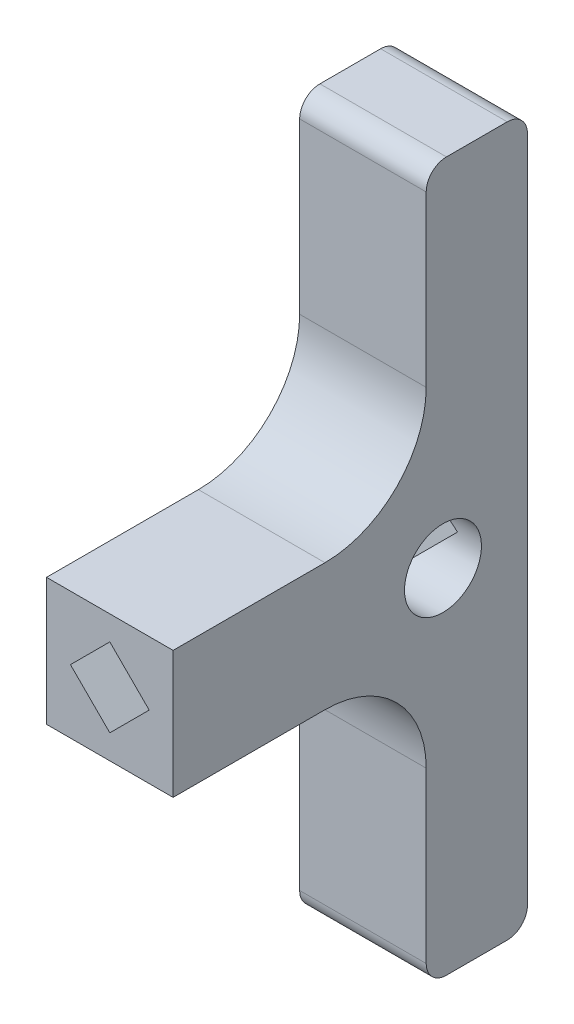
ISO-10303-21;
HEADER;
FILE_DESCRIPTION(('STEP AP214'),'2;1');
FILE_NAME('part.step','',(''),(''),'','','');
FILE_SCHEMA(('AUTOMOTIVE_DESIGN { 1 0 10303 214 1 1 1 1 }'));
ENDSEC;
DATA;
#1=APPLICATION_CONTEXT('core data for automotive mechanical design processes');
#2=APPLICATION_PROTOCOL_DEFINITION('international standard','automotive_design',2000,#1);
#3=PRODUCT_CONTEXT('',#1,'mechanical');
#4=PRODUCT('Part','Part','',(#3));
#5=PRODUCT_RELATED_PRODUCT_CATEGORY('part','',(#4));
#6=PRODUCT_DEFINITION_FORMATION('','',#4);
#7=PRODUCT_DEFINITION_CONTEXT('part definition',#1,'design');
#8=PRODUCT_DEFINITION('design','',#6,#7);
#9=PRODUCT_DEFINITION_SHAPE('','',#8);
#10=(LENGTH_UNIT() NAMED_UNIT(*) SI_UNIT(.MILLI.,.METRE.));
#11=(NAMED_UNIT(*) PLANE_ANGLE_UNIT() SI_UNIT($,.RADIAN.));
#12=(NAMED_UNIT(*) SI_UNIT($,.STERADIAN.) SOLID_ANGLE_UNIT());
#13=UNCERTAINTY_MEASURE_WITH_UNIT(LENGTH_MEASURE(1.E-05),#10,'distance_accuracy_value','');
#14=(GEOMETRIC_REPRESENTATION_CONTEXT(3) GLOBAL_UNCERTAINTY_ASSIGNED_CONTEXT((#13)) GLOBAL_UNIT_ASSIGNED_CONTEXT((#10,
#11,#12)) REPRESENTATION_CONTEXT('',''));
#15=CARTESIAN_POINT('',(0.,0.,0.));
#16=DIRECTION('',(0.,0.,1.));
#17=DIRECTION('',(1.,0.,0.));
#18=AXIS2_PLACEMENT_3D('',#15,#16,#17);
#19=CARTESIAN_POINT('',(6.25,35.,10.));
#20=DIRECTION('',(-1.,0.,0.));
#21=DIRECTION('',(0.,-1.,0.));
#22=AXIS2_PLACEMENT_3D('',#19,#20,#21);
#23=PLANE('',#22);
#24=DIRECTION('',(0.,1.,0.));
#25=VECTOR('',#24,1.);
#26=CARTESIAN_POINT('',(6.25,35.,10.));
#27=LINE('',#26,#25);
#28=CARTESIAN_POINT('',(6.25000000000001,-33.,10.));
#29=VERTEX_POINT('',#28);
#30=CARTESIAN_POINT('',(6.25,-16.2884586432121,10.));
#31=VERTEX_POINT('',#30);
#32=EDGE_CURVE('E220',#29,#31,#27,.T.);
#33=ORIENTED_EDGE('',*,*,#32,.F.);
#34=CARTESIAN_POINT('',(6.25000000000001,-33.,8.));
#35=DIRECTION('',(-1.,0.,0.));
#36=DIRECTION('',(0.,-1.,0.));
#37=AXIS2_PLACEMENT_3D('',#34,#35,#36);
#38=CIRCLE('',#37,2.);
#39=CARTESIAN_POINT('',(6.25000000000001,-35.,8.));
#40=VERTEX_POINT('',#39);
#41=EDGE_CURVE('E281',#29,#40,#38,.F.);
#42=ORIENTED_EDGE('',*,*,#41,.T.);
#43=DIRECTION('',(0.,0.,-1.));
#44=VECTOR('',#43,1.);
#45=CARTESIAN_POINT('',(6.25000000000001,-35.,10.));
#46=LINE('',#45,#44);
#47=CARTESIAN_POINT('',(6.25000000000001,-35.,2.));
#48=VERTEX_POINT('',#47);
#49=EDGE_CURVE('E226',#40,#48,#46,.T.);
#50=ORIENTED_EDGE('',*,*,#49,.T.);
#51=CARTESIAN_POINT('',(6.25000000000001,-33.,2.));
#52=DIRECTION('',(-1.,0.,0.));
#53=DIRECTION('',(0.,-1.,0.));
#54=AXIS2_PLACEMENT_3D('',#51,#52,#53);
#55=CIRCLE('',#54,2.);
#56=CARTESIAN_POINT('',(6.25000000000001,-33.,0.));
#57=VERTEX_POINT('',#56);
#58=EDGE_CURVE('E279',#48,#57,#55,.F.);
#59=ORIENTED_EDGE('',*,*,#58,.T.);
#60=DIRECTION('',(0.,1.,0.));
#61=VECTOR('',#60,1.);
#62=CARTESIAN_POINT('',(6.25,35.,0.));
#63=LINE('',#62,#61);
#64=CARTESIAN_POINT('',(6.25,33.,0.));
#65=VERTEX_POINT('',#64);
#66=EDGE_CURVE('E211',#57,#65,#63,.T.);
#67=ORIENTED_EDGE('',*,*,#66,.T.);
#68=CARTESIAN_POINT('',(6.25,33.,2.));
#69=DIRECTION('',(-1.,0.,0.));
#70=DIRECTION('',(0.,-1.,0.));
#71=AXIS2_PLACEMENT_3D('',#68,#69,#70);
#72=CIRCLE('',#71,2.);
#73=CARTESIAN_POINT('',(6.25,35.,2.));
#74=VERTEX_POINT('',#73);
#75=EDGE_CURVE('E277',#65,#74,#72,.F.);
#76=ORIENTED_EDGE('',*,*,#75,.T.);
#77=DIRECTION('',(0.,0.,-1.));
#78=VECTOR('',#77,1.);
#79=CARTESIAN_POINT('',(6.25,35.,10.));
#80=LINE('',#79,#78);
#81=CARTESIAN_POINT('',(6.25,35.,8.));
#82=VERTEX_POINT('',#81);
#83=EDGE_CURVE('E240',#82,#74,#80,.T.);
#84=ORIENTED_EDGE('',*,*,#83,.F.);
#85=CARTESIAN_POINT('',(6.25,33.,8.));
#86=DIRECTION('',(-1.,0.,0.));
#87=DIRECTION('',(0.,-1.,0.));
#88=AXIS2_PLACEMENT_3D('',#85,#86,#87);
#89=CIRCLE('',#88,2.);
#90=CARTESIAN_POINT('',(6.25,33.,10.));
#91=VERTEX_POINT('',#90);
#92=EDGE_CURVE('E275',#82,#91,#89,.F.);
#93=ORIENTED_EDGE('',*,*,#92,.T.);
#94=CARTESIAN_POINT('',(6.25,16.2884586432121,10.));
#95=VERTEX_POINT('',#94);
#96=EDGE_CURVE('E223',#95,#91,#27,.T.);
#97=ORIENTED_EDGE('',*,*,#96,.F.);
#98=CARTESIAN_POINT('',(6.25,16.2884586432121,20.));
#99=DIRECTION('',(-1.,0.,0.));
#100=DIRECTION('',(0.,-1.,0.));
#101=AXIS2_PLACEMENT_3D('',#98,#99,#100);
#102=CIRCLE('',#101,10.);
#103=CARTESIAN_POINT('',(6.25,6.28845864321206,20.));
#104=VERTEX_POINT('',#103);
#105=EDGE_CURVE('E270',#95,#104,#102,.T.);
#106=ORIENTED_EDGE('',*,*,#105,.T.);
#107=DIRECTION('',(0.,0.,-1.));
#108=VECTOR('',#107,1.);
#109=CARTESIAN_POINT('',(6.25,6.28845864321206,35.));
#110=LINE('',#109,#108);
#111=CARTESIAN_POINT('',(6.25,6.28845864321206,35.));
#112=VERTEX_POINT('',#111);
#113=EDGE_CURVE('E215',#112,#104,#110,.T.);
#114=ORIENTED_EDGE('',*,*,#113,.F.);
#115=DIRECTION('',(0.,-1.,0.));
#116=VECTOR('',#115,1.);
#117=CARTESIAN_POINT('',(6.25,6.28845864321206,35.));
#118=LINE('',#117,#116);
#119=CARTESIAN_POINT('',(6.25,-6.28845864321206,35.));
#120=VERTEX_POINT('',#119);
#121=EDGE_CURVE('E201',#112,#120,#118,.T.);
#122=ORIENTED_EDGE('',*,*,#121,.T.);
#123=DIRECTION('',(0.,0.,-1.));
#124=VECTOR('',#123,1.);
#125=CARTESIAN_POINT('',(6.25,-6.28845864321206,35.));
#126=LINE('',#125,#124);
#127=CARTESIAN_POINT('',(6.25,-6.28845864321206,20.));
#128=VERTEX_POINT('',#127);
#129=EDGE_CURVE('E212',#120,#128,#126,.T.);
#130=ORIENTED_EDGE('',*,*,#129,.T.);
#131=CARTESIAN_POINT('',(6.25,-16.2884586432121,20.));
#132=DIRECTION('',(-1.,0.,0.));
#133=DIRECTION('',(0.,-1.,0.));
#134=AXIS2_PLACEMENT_3D('',#131,#132,#133);
#135=CIRCLE('',#134,10.);
#136=EDGE_CURVE('E262',#128,#31,#135,.T.);
#137=ORIENTED_EDGE('',*,*,#136,.T.);
#138=EDGE_LOOP('',(#33,#42,#50,#59,#67,#76,#84,#93,#97,#106,#114,#122,#130,#137));
#139=FACE_BOUND('',#138,.T.);
#140=CARTESIAN_POINT('',(6.25,0.,8.34476247266945));
#141=DIRECTION('',(-1.,0.,0.));
#142=DIRECTION('',(0.,-1.,0.));
#143=AXIS2_PLACEMENT_3D('',#140,#141,#142);
#144=CIRCLE('',#143,3.79999999999999);
#145=CARTESIAN_POINT('',(6.25,-3.79999999999999,8.34476247266945));
#146=VERTEX_POINT('',#145);
#147=EDGE_CURVE('E177',#146,#146,#144,.F.);
#148=ORIENTED_EDGE('',*,*,#147,.F.);
#149=EDGE_LOOP('',(#148));
#150=FACE_BOUND('',#149,.T.);
#151=ADVANCED_FACE('F33',(#139,#150),#23,.F.);
#152=CARTESIAN_POINT('',(0.,0.,10.));
#153=DIRECTION('',(0.,0.,1.));
#154=DIRECTION('',(1.,0.,0.));
#155=AXIS2_PLACEMENT_3D('',#152,#153,#154);
#156=PLANE('',#155);
#157=DIRECTION('',(0.,-1.,0.));
#158=VECTOR('',#157,1.);
#159=CARTESIAN_POINT('',(-6.25000000000001,35.,10.));
#160=LINE('',#159,#158);
#161=CARTESIAN_POINT('',(-6.25,-16.2884586432121,10.));
#162=VERTEX_POINT('',#161);
#163=CARTESIAN_POINT('',(-6.25,-33.,10.));
#164=VERTEX_POINT('',#163);
#165=EDGE_CURVE('E222',#162,#164,#160,.T.);
#166=ORIENTED_EDGE('',*,*,#165,.T.);
#167=DIRECTION('',(1.,0.,0.));
#168=VECTOR('',#167,1.);
#169=CARTESIAN_POINT('',(6.25000000000001,-33.,10.));
#170=LINE('',#169,#168);
#171=EDGE_CURVE('E272',#164,#29,#170,.T.);
#172=ORIENTED_EDGE('',*,*,#171,.T.);
#173=ORIENTED_EDGE('',*,*,#32,.T.);
#174=DIRECTION('',(1.,0.,0.));
#175=VECTOR('',#174,1.);
#176=CARTESIAN_POINT('',(-6.25,-16.2884586432121,10.));
#177=LINE('',#176,#175);
#178=EDGE_CURVE('E255',#31,#162,#177,.F.);
#179=ORIENTED_EDGE('',*,*,#178,.T.);
#180=EDGE_LOOP('',(#166,#172,#173,#179));
#181=FACE_BOUND('',#180,.T.);
#182=ADVANCED_FACE('F355',(#181),#156,.T.);
#183=CARTESIAN_POINT('',(-6.25000000000001,35.,10.));
#184=DIRECTION('',(0.,-1.,0.));
#185=DIRECTION('',(0.,0.,-1.));
#186=AXIS2_PLACEMENT_3D('',#183,#184,#185);
#187=PLANE('',#186);
#188=ORIENTED_EDGE('',*,*,#83,.T.);
#189=DIRECTION('',(-1.,0.,0.));
#190=VECTOR('',#189,1.);
#191=CARTESIAN_POINT('',(-6.25000000000001,35.,2.));
#192=LINE('',#191,#190);
#193=CARTESIAN_POINT('',(-6.25000000000001,35.,2.));
#194=VERTEX_POINT('',#193);
#195=EDGE_CURVE('E302',#74,#194,#192,.T.);
#196=ORIENTED_EDGE('',*,*,#195,.T.);
#197=DIRECTION('',(0.,0.,-1.));
#198=VECTOR('',#197,1.);
#199=CARTESIAN_POINT('',(-6.25000000000001,35.,10.));
#200=LINE('',#199,#198);
#201=CARTESIAN_POINT('',(-6.25000000000001,35.,8.));
#202=VERTEX_POINT('',#201);
#203=EDGE_CURVE('E237',#202,#194,#200,.T.);
#204=ORIENTED_EDGE('',*,*,#203,.F.);
#205=DIRECTION('',(-1.,0.,0.));
#206=VECTOR('',#205,1.);
#207=CARTESIAN_POINT('',(6.25,35.,8.));
#208=LINE('',#207,#206);
#209=EDGE_CURVE('E300',#202,#82,#208,.F.);
#210=ORIENTED_EDGE('',*,*,#209,.T.);
#211=EDGE_LOOP('',(#188,#196,#204,#210));
#212=FACE_BOUND('',#211,.T.);
#213=ADVANCED_FACE('F328',(#212),#187,.F.);
#214=CARTESIAN_POINT('',(-6.25000000000001,35.,10.));
#215=DIRECTION('',(1.,0.,0.));
#216=DIRECTION('',(0.,1.,0.));
#217=AXIS2_PLACEMENT_3D('',#214,#215,#216);
#218=PLANE('',#217);
#219=CARTESIAN_POINT('',(-6.25,0.,8.34476247266945));
#220=DIRECTION('',(-1.,0.,0.));
#221=DIRECTION('',(0.,0.,1.));
#222=AXIS2_PLACEMENT_3D('',#219,#220,#221);
#223=CIRCLE('',#222,3.79999999999999);
#224=CARTESIAN_POINT('',(-6.25,0.,12.1447624726694));
#225=VERTEX_POINT('',#224);
#226=EDGE_CURVE('E440',#225,#225,#223,.T.);
#227=ORIENTED_EDGE('',*,*,#226,.F.);
#228=EDGE_LOOP('',(#227));
#229=FACE_BOUND('',#228,.T.);
#230=DIRECTION('',(0.,0.,-1.));
#231=VECTOR('',#230,1.);
#232=CARTESIAN_POINT('',(-6.25,-35.,10.));
#233=LINE('',#232,#231);
#234=CARTESIAN_POINT('',(-6.25,-35.,8.));
#235=VERTEX_POINT('',#234);
#236=CARTESIAN_POINT('',(-6.25,-35.,2.));
#237=VERTEX_POINT('',#236);
#238=EDGE_CURVE('E234',#235,#237,#233,.T.);
#239=ORIENTED_EDGE('',*,*,#238,.F.);
#240=CARTESIAN_POINT('',(-6.25,-33.,8.));
#241=DIRECTION('',(1.,0.,0.));
#242=DIRECTION('',(0.,1.,0.));
#243=AXIS2_PLACEMENT_3D('',#240,#241,#242);
#244=CIRCLE('',#243,2.);
#245=EDGE_CURVE('E294',#235,#164,#244,.F.);
#246=ORIENTED_EDGE('',*,*,#245,.T.);
#247=ORIENTED_EDGE('',*,*,#165,.F.);
#248=CARTESIAN_POINT('',(-6.25,-16.2884586432121,20.));
#249=DIRECTION('',(1.,0.,0.));
#250=DIRECTION('',(0.,1.,0.));
#251=AXIS2_PLACEMENT_3D('',#248,#249,#250);
#252=CIRCLE('',#251,10.);
#253=CARTESIAN_POINT('',(-6.25,-6.28845864321206,20.));
#254=VERTEX_POINT('',#253);
#255=EDGE_CURVE('E265',#162,#254,#252,.T.);
#256=ORIENTED_EDGE('',*,*,#255,.T.);
#257=DIRECTION('',(0.,0.,-1.));
#258=VECTOR('',#257,1.);
#259=CARTESIAN_POINT('',(-6.25,-6.28845864321206,35.));
#260=LINE('',#259,#258);
#261=CARTESIAN_POINT('',(-6.25,-6.28845864321206,35.));
#262=VERTEX_POINT('',#261);
#263=EDGE_CURVE('E208',#262,#254,#260,.T.);
#264=ORIENTED_EDGE('',*,*,#263,.F.);
#265=DIRECTION('',(0.,1.,0.));
#266=VECTOR('',#265,1.);
#267=CARTESIAN_POINT('',(-6.25,6.28845864321206,35.));
#268=LINE('',#267,#266);
#269=CARTESIAN_POINT('',(-6.25,6.28845864321206,35.));
#270=VERTEX_POINT('',#269);
#271=EDGE_CURVE('E194',#262,#270,#268,.T.);
#272=ORIENTED_EDGE('',*,*,#271,.T.);
#273=DIRECTION('',(0.,0.,-1.));
#274=VECTOR('',#273,1.);
#275=CARTESIAN_POINT('',(-6.25,6.28845864321206,35.));
#276=LINE('',#275,#274);
#277=CARTESIAN_POINT('',(-6.25,6.28845864321206,20.));
#278=VERTEX_POINT('',#277);
#279=EDGE_CURVE('E207',#270,#278,#276,.T.);
#280=ORIENTED_EDGE('',*,*,#279,.T.);
#281=CARTESIAN_POINT('',(-6.25,16.2884586432121,20.));
#282=DIRECTION('',(1.,0.,0.));
#283=DIRECTION('',(0.,1.,0.));
#284=AXIS2_PLACEMENT_3D('',#281,#282,#283);
#285=CIRCLE('',#284,10.);
#286=CARTESIAN_POINT('',(-6.25,16.2884586432121,10.));
#287=VERTEX_POINT('',#286);
#288=EDGE_CURVE('E267',#278,#287,#285,.T.);
#289=ORIENTED_EDGE('',*,*,#288,.T.);
#290=CARTESIAN_POINT('',(-6.25000000000001,33.,10.));
#291=VERTEX_POINT('',#290);
#292=EDGE_CURVE('E224',#291,#287,#160,.T.);
#293=ORIENTED_EDGE('',*,*,#292,.F.);
#294=CARTESIAN_POINT('',(-6.25000000000001,33.,8.));
#295=DIRECTION('',(1.,0.,0.));
#296=DIRECTION('',(0.,1.,0.));
#297=AXIS2_PLACEMENT_3D('',#294,#295,#296);
#298=CIRCLE('',#297,2.);
#299=EDGE_CURVE('E288',#291,#202,#298,.F.);
#300=ORIENTED_EDGE('',*,*,#299,.T.);
#301=ORIENTED_EDGE('',*,*,#203,.T.);
#302=CARTESIAN_POINT('',(-6.25000000000001,33.,2.));
#303=DIRECTION('',(1.,0.,0.));
#304=DIRECTION('',(0.,1.,0.));
#305=AXIS2_PLACEMENT_3D('',#302,#303,#304);
#306=CIRCLE('',#305,2.);
#307=CARTESIAN_POINT('',(-6.25000000000001,33.,0.));
#308=VERTEX_POINT('',#307);
#309=EDGE_CURVE('E290',#194,#308,#306,.F.);
#310=ORIENTED_EDGE('',*,*,#309,.T.);
#311=DIRECTION('',(0.,-1.,0.));
#312=VECTOR('',#311,1.);
#313=CARTESIAN_POINT('',(-6.25000000000001,35.,0.));
#314=LINE('',#313,#312);
#315=CARTESIAN_POINT('',(-6.25,-33.,0.));
#316=VERTEX_POINT('',#315);
#317=EDGE_CURVE('E229',#308,#316,#314,.T.);
#318=ORIENTED_EDGE('',*,*,#317,.T.);
#319=CARTESIAN_POINT('',(-6.25,-33.,2.));
#320=DIRECTION('',(1.,0.,0.));
#321=DIRECTION('',(0.,1.,0.));
#322=AXIS2_PLACEMENT_3D('',#319,#320,#321);
#323=CIRCLE('',#322,2.);
#324=EDGE_CURVE('E292',#316,#237,#323,.F.);
#325=ORIENTED_EDGE('',*,*,#324,.T.);
#326=EDGE_LOOP('',(#239,#246,#247,#256,#264,#272,#280,#289,#293,#300,#301,#310,#318,#325));
#327=FACE_BOUND('',#326,.T.);
#328=ADVANCED_FACE('F315',(#229,#327),#218,.F.);
#329=CARTESIAN_POINT('',(-6.25,-35.,10.));
#330=DIRECTION('',(0.,1.,0.));
#331=DIRECTION('',(0.,0.,1.));
#332=AXIS2_PLACEMENT_3D('',#329,#330,#331);
#333=PLANE('',#332);
#334=ORIENTED_EDGE('',*,*,#49,.F.);
#335=DIRECTION('',(1.,0.,0.));
#336=VECTOR('',#335,1.);
#337=CARTESIAN_POINT('',(-6.25,-35.,8.));
#338=LINE('',#337,#336);
#339=EDGE_CURVE('E286',#40,#235,#338,.F.);
#340=ORIENTED_EDGE('',*,*,#339,.T.);
#341=ORIENTED_EDGE('',*,*,#238,.T.);
#342=DIRECTION('',(1.,0.,0.));
#343=VECTOR('',#342,1.);
#344=CARTESIAN_POINT('',(-6.25,-35.,2.));
#345=LINE('',#344,#343);
#346=EDGE_CURVE('E283',#237,#48,#345,.T.);
#347=ORIENTED_EDGE('',*,*,#346,.T.);
#348=EDGE_LOOP('',(#334,#340,#341,#347));
#349=FACE_BOUND('',#348,.T.);
#350=ADVANCED_FACE('F346',(#349),#333,.F.);
#351=ORIENTED_EDGE('',*,*,#96,.T.);
#352=DIRECTION('',(-1.,0.,0.));
#353=VECTOR('',#352,1.);
#354=CARTESIAN_POINT('',(-6.25000000000001,33.,10.));
#355=LINE('',#354,#353);
#356=EDGE_CURVE('E41',#91,#291,#355,.T.);
#357=ORIENTED_EDGE('',*,*,#356,.T.);
#358=ORIENTED_EDGE('',*,*,#292,.T.);
#359=DIRECTION('',(-1.,0.,0.));
#360=VECTOR('',#359,1.);
#361=CARTESIAN_POINT('',(6.25,16.2884586432121,10.));
#362=LINE('',#361,#360);
#363=EDGE_CURVE('E260',#287,#95,#362,.F.);
#364=ORIENTED_EDGE('',*,*,#363,.T.);
#365=EDGE_LOOP('',(#351,#357,#358,#364));
#366=FACE_BOUND('',#365,.T.);
#367=ADVANCED_FACE('F309',(#366),#156,.T.);
#368=CARTESIAN_POINT('',(0.,0.,0.));
#369=DIRECTION('',(0.,0.,1.));
#370=DIRECTION('',(1.,0.,0.));
#371=AXIS2_PLACEMENT_3D('',#368,#369,#370);
#372=PLANE('',#371);
#373=DIRECTION('',(0.707106781186548,-0.707106781186547,0.));
#374=VECTOR('',#373,1.);
#375=CARTESIAN_POINT('',(3.88908729652601,0.,0.));
#376=LINE('',#375,#374);
#377=CARTESIAN_POINT('',(0.,3.88908729652601,0.));
#378=VERTEX_POINT('',#377);
#379=CARTESIAN_POINT('',(3.88908729652601,0.,0.));
#380=VERTEX_POINT('',#379);
#381=EDGE_CURVE('E434',#378,#380,#376,.T.);
#382=ORIENTED_EDGE('',*,*,#381,.F.);
#383=DIRECTION('',(0.707106781186548,0.707106781186548,0.));
#384=VECTOR('',#383,1.);
#385=CARTESIAN_POINT('',(0.,3.88908729652601,0.));
#386=LINE('',#385,#384);
#387=CARTESIAN_POINT('',(-3.88908729652601,0.,0.));
#388=VERTEX_POINT('',#387);
#389=EDGE_CURVE('E436',#388,#378,#386,.T.);
#390=ORIENTED_EDGE('',*,*,#389,.F.);
#391=DIRECTION('',(-0.707106781186548,0.707106781186548,0.));
#392=VECTOR('',#391,1.);
#393=CARTESIAN_POINT('',(0.,-3.88908729652601,0.));
#394=LINE('',#393,#392);
#395=CARTESIAN_POINT('',(0.,-3.88908729652601,0.));
#396=VERTEX_POINT('',#395);
#397=EDGE_CURVE('E193',#396,#388,#394,.T.);
#398=ORIENTED_EDGE('',*,*,#397,.F.);
#399=DIRECTION('',(-0.707106781186548,-0.707106781186548,0.));
#400=VECTOR('',#399,1.);
#401=CARTESIAN_POINT('',(3.88908729652601,0.,0.));
#402=LINE('',#401,#400);
#403=EDGE_CURVE('E431',#380,#396,#402,.T.);
#404=ORIENTED_EDGE('',*,*,#403,.F.);
#405=EDGE_LOOP('',(#382,#390,#398,#404));
#406=FACE_BOUND('',#405,.T.);
#407=ORIENTED_EDGE('',*,*,#66,.F.);
#408=DIRECTION('',(1.,0.,0.));
#409=VECTOR('',#408,1.);
#410=CARTESIAN_POINT('',(0.,-33.,0.));
#411=LINE('',#410,#409);
#412=EDGE_CURVE('E298',#57,#316,#411,.F.);
#413=ORIENTED_EDGE('',*,*,#412,.T.);
#414=ORIENTED_EDGE('',*,*,#317,.F.);
#415=DIRECTION('',(-1.,0.,0.));
#416=VECTOR('',#415,1.);
#417=CARTESIAN_POINT('',(0.,33.,0.));
#418=LINE('',#417,#416);
#419=EDGE_CURVE('E296',#308,#65,#418,.F.);
#420=ORIENTED_EDGE('',*,*,#419,.T.);
#421=EDGE_LOOP('',(#407,#413,#414,#420));
#422=FACE_BOUND('',#421,.T.);
#423=ADVANCED_FACE('F336',(#406,#422),#372,.F.);
#424=CARTESIAN_POINT('',(6.25,-6.28845864321206,35.));
#425=DIRECTION('',(0.,-1.,0.));
#426=DIRECTION('',(0.,0.,-1.));
#427=AXIS2_PLACEMENT_3D('',#424,#425,#426);
#428=PLANE('',#427);
#429=ORIENTED_EDGE('',*,*,#263,.T.);
#430=DIRECTION('',(1.,0.,0.));
#431=VECTOR('',#430,1.);
#432=CARTESIAN_POINT('',(6.25,-6.28845864321206,20.));
#433=LINE('',#432,#431);
#434=EDGE_CURVE('E252',#254,#128,#433,.T.);
#435=ORIENTED_EDGE('',*,*,#434,.T.);
#436=ORIENTED_EDGE('',*,*,#129,.F.);
#437=DIRECTION('',(-1.,0.,0.));
#438=VECTOR('',#437,1.);
#439=CARTESIAN_POINT('',(6.25,-6.28845864321206,35.));
#440=LINE('',#439,#438);
#441=EDGE_CURVE('E204',#120,#262,#440,.T.);
#442=ORIENTED_EDGE('',*,*,#441,.T.);
#443=EDGE_LOOP('',(#429,#435,#436,#442));
#444=FACE_BOUND('',#443,.T.);
#445=ADVANCED_FACE('F362',(#444),#428,.T.);
#446=CARTESIAN_POINT('',(6.25,6.28845864321206,35.));
#447=DIRECTION('',(0.,1.,0.));
#448=DIRECTION('',(0.,0.,1.));
#449=AXIS2_PLACEMENT_3D('',#446,#447,#448);
#450=PLANE('',#449);
#451=ORIENTED_EDGE('',*,*,#113,.T.);
#452=DIRECTION('',(-1.,0.,0.));
#453=VECTOR('',#452,1.);
#454=CARTESIAN_POINT('',(-6.25,6.28845864321206,20.));
#455=LINE('',#454,#453);
#456=EDGE_CURVE('E257',#104,#278,#455,.T.);
#457=ORIENTED_EDGE('',*,*,#456,.T.);
#458=ORIENTED_EDGE('',*,*,#279,.F.);
#459=DIRECTION('',(1.,0.,0.));
#460=VECTOR('',#459,1.);
#461=CARTESIAN_POINT('',(6.25,6.28845864321206,35.));
#462=LINE('',#461,#460);
#463=EDGE_CURVE('E197',#270,#112,#462,.T.);
#464=ORIENTED_EDGE('',*,*,#463,.T.);
#465=EDGE_LOOP('',(#451,#457,#458,#464));
#466=FACE_BOUND('',#465,.T.);
#467=ADVANCED_FACE('F369',(#466),#450,.T.);
#468=CARTESIAN_POINT('',(0.,0.,35.));
#469=DIRECTION('',(0.,0.,-1.));
#470=DIRECTION('',(-1.,0.,0.));
#471=AXIS2_PLACEMENT_3D('',#468,#469,#470);
#472=PLANE('',#471);
#473=DIRECTION('',(-0.707106781186548,0.707106781186548,0.));
#474=VECTOR('',#473,1.);
#475=CARTESIAN_POINT('',(-1.94454364826301,-1.94454364826301,35.));
#476=LINE('',#475,#474);
#477=CARTESIAN_POINT('',(0.,-3.88908729652601,35.));
#478=VERTEX_POINT('',#477);
#479=CARTESIAN_POINT('',(-3.88908729652601,0.,35.));
#480=VERTEX_POINT('',#479);
#481=EDGE_CURVE('E246',#478,#480,#476,.T.);
#482=ORIENTED_EDGE('',*,*,#481,.T.);
#483=DIRECTION('',(0.707106781186548,0.707106781186548,0.));
#484=VECTOR('',#483,1.);
#485=CARTESIAN_POINT('',(-1.94454364826301,1.94454364826301,35.));
#486=LINE('',#485,#484);
#487=CARTESIAN_POINT('',(0.,3.88908729652601,35.));
#488=VERTEX_POINT('',#487);
#489=EDGE_CURVE('E249',#480,#488,#486,.T.);
#490=ORIENTED_EDGE('',*,*,#489,.T.);
#491=DIRECTION('',(0.707106781186548,-0.707106781186547,0.));
#492=VECTOR('',#491,1.);
#493=CARTESIAN_POINT('',(1.94454364826301,1.94454364826301,35.));
#494=LINE('',#493,#492);
#495=CARTESIAN_POINT('',(3.88908729652601,0.,35.));
#496=VERTEX_POINT('',#495);
#497=EDGE_CURVE('E243',#488,#496,#494,.T.);
#498=ORIENTED_EDGE('',*,*,#497,.T.);
#499=DIRECTION('',(-0.707106781186548,-0.707106781186548,0.));
#500=VECTOR('',#499,1.);
#501=CARTESIAN_POINT('',(1.94454364826301,-1.94454364826301,35.));
#502=LINE('',#501,#500);
#503=EDGE_CURVE('E182',#496,#478,#502,.T.);
#504=ORIENTED_EDGE('',*,*,#503,.T.);
#505=EDGE_LOOP('',(#482,#490,#498,#504));
#506=FACE_BOUND('',#505,.T.);
#507=ORIENTED_EDGE('',*,*,#271,.F.);
#508=ORIENTED_EDGE('',*,*,#441,.F.);
#509=ORIENTED_EDGE('',*,*,#121,.F.);
#510=ORIENTED_EDGE('',*,*,#463,.F.);
#511=EDGE_LOOP('',(#507,#508,#509,#510));
#512=FACE_BOUND('',#511,.T.);
#513=ADVANCED_FACE('F366',(#506,#512),#472,.F.);
#514=CARTESIAN_POINT('',(0.,3.88908729652601,40.));
#515=DIRECTION('',(-0.707106781186548,0.707106781186548,0.));
#516=DIRECTION('',(-0.707106781186548,-0.707106781186548,0.));
#517=AXIS2_PLACEMENT_3D('',#514,#515,#516);
#518=PLANE('',#517);
#519=DIRECTION('',(0.,0.,-1.));
#520=VECTOR('',#519,1.);
#521=CARTESIAN_POINT('',(-3.88908729652601,0.,40.));
#522=LINE('',#521,#520);
#523=CARTESIAN_POINT('',(-3.88908729652601,0.,12.1447624726694));
#524=VERTEX_POINT('',#523);
#525=EDGE_CURVE('E198',#480,#524,#522,.T.);
#526=ORIENTED_EDGE('',*,*,#525,.T.);
#527=CARTESIAN_POINT('',(-3.88908729652601,0.,8.34476247266945));
#528=DIRECTION('',(-0.707106781186548,0.707106781186548,0.));
#529=DIRECTION('',(-0.707106781186548,-0.707106781186548,0.));
#530=AXIS2_PLACEMENT_3D('',#527,#528,#529);
#531=ELLIPSE('',#530,5.37401153701775,3.79999999999999);
#532=CARTESIAN_POINT('',(-3.88908729652601,0.,4.54476247266947));
#533=VERTEX_POINT('',#532);
#534=EDGE_CURVE('E47',#524,#533,#531,.T.);
#535=ORIENTED_EDGE('',*,*,#534,.T.);
#536=EDGE_CURVE('E186',#533,#388,#522,.T.);
#537=ORIENTED_EDGE('',*,*,#536,.T.);
#538=ORIENTED_EDGE('',*,*,#389,.T.);
#539=DIRECTION('',(0.,0.,-1.));
#540=VECTOR('',#539,1.);
#541=CARTESIAN_POINT('',(0.,3.88908729652601,40.));
#542=LINE('',#541,#540);
#543=EDGE_CURVE('E188',#488,#378,#542,.T.);
#544=ORIENTED_EDGE('',*,*,#543,.F.);
#545=ORIENTED_EDGE('',*,*,#489,.F.);
#546=EDGE_LOOP('',(#526,#535,#537,#538,#544,#545));
#547=FACE_BOUND('',#546,.T.);
#548=ADVANCED_FACE('F376',(#547),#518,.F.);
#549=CARTESIAN_POINT('',(0.,-3.88908729652601,40.));
#550=DIRECTION('',(-0.707106781186548,-0.707106781186548,0.));
#551=DIRECTION('',(0.707106781186548,-0.707106781186548,0.));
#552=AXIS2_PLACEMENT_3D('',#549,#550,#551);
#553=PLANE('',#552);
#554=ORIENTED_EDGE('',*,*,#536,.F.);
#555=CARTESIAN_POINT('',(-3.88908729652601,0.,8.34476247266945));
#556=DIRECTION('',(-0.707106781186548,-0.707106781186548,0.));
#557=DIRECTION('',(-0.707106781186548,0.707106781186548,0.));
#558=AXIS2_PLACEMENT_3D('',#555,#556,#557);
#559=ELLIPSE('',#558,5.37401153701775,3.79999999999999);
#560=EDGE_CURVE('E176',#533,#524,#559,.T.);
#561=ORIENTED_EDGE('',*,*,#560,.T.);
#562=ORIENTED_EDGE('',*,*,#525,.F.);
#563=ORIENTED_EDGE('',*,*,#481,.F.);
#564=DIRECTION('',(0.,0.,-1.));
#565=VECTOR('',#564,1.);
#566=CARTESIAN_POINT('',(0.,-3.88908729652601,40.));
#567=LINE('',#566,#565);
#568=EDGE_CURVE('E184',#478,#396,#567,.T.);
#569=ORIENTED_EDGE('',*,*,#568,.T.);
#570=ORIENTED_EDGE('',*,*,#397,.T.);
#571=EDGE_LOOP('',(#554,#561,#562,#563,#569,#570));
#572=FACE_BOUND('',#571,.T.);
#573=ADVANCED_FACE('F412',(#572),#553,.F.);
#574=CARTESIAN_POINT('',(3.88908729652601,0.,40.));
#575=DIRECTION('',(0.707106781186548,-0.707106781186548,0.));
#576=DIRECTION('',(0.707106781186548,0.707106781186548,0.));
#577=AXIS2_PLACEMENT_3D('',#574,#575,#576);
#578=PLANE('',#577);
#579=DIRECTION('',(0.,0.,-1.));
#580=VECTOR('',#579,1.);
#581=CARTESIAN_POINT('',(3.88908729652601,0.,40.));
#582=LINE('',#581,#580);
#583=CARTESIAN_POINT('',(3.88908729652601,0.,12.1447624726694));
#584=VERTEX_POINT('',#583);
#585=EDGE_CURVE('E172',#496,#584,#582,.T.);
#586=ORIENTED_EDGE('',*,*,#585,.T.);
#587=CARTESIAN_POINT('',(3.88908729652601,0.,8.34476247266945));
#588=DIRECTION('',(0.707106781186548,-0.707106781186548,0.));
#589=DIRECTION('',(-0.707106781186548,-0.707106781186548,0.));
#590=AXIS2_PLACEMENT_3D('',#587,#588,#589);
#591=ELLIPSE('',#590,5.37401153701775,3.79999999999999);
#592=CARTESIAN_POINT('',(3.88908729652601,0.,4.54476247266947));
#593=VERTEX_POINT('',#592);
#594=EDGE_CURVE('E11',#584,#593,#591,.T.);
#595=ORIENTED_EDGE('',*,*,#594,.T.);
#596=EDGE_CURVE('E175',#593,#380,#582,.T.);
#597=ORIENTED_EDGE('',*,*,#596,.T.);
#598=ORIENTED_EDGE('',*,*,#403,.T.);
#599=ORIENTED_EDGE('',*,*,#568,.F.);
#600=ORIENTED_EDGE('',*,*,#503,.F.);
#601=EDGE_LOOP('',(#586,#595,#597,#598,#599,#600));
#602=FACE_BOUND('',#601,.T.);
#603=ADVANCED_FACE('F179',(#602),#578,.F.);
#604=CARTESIAN_POINT('',(3.88908729652601,0.,40.));
#605=DIRECTION('',(0.707106781186547,0.707106781186548,0.));
#606=DIRECTION('',(-0.707106781186548,0.707106781186547,0.));
#607=AXIS2_PLACEMENT_3D('',#604,#605,#606);
#608=PLANE('',#607);
#609=ORIENTED_EDGE('',*,*,#596,.F.);
#610=CARTESIAN_POINT('',(3.88908729652601,0.,8.34476247266945));
#611=DIRECTION('',(0.707106781186547,0.707106781186548,0.));
#612=DIRECTION('',(-0.707106781186548,0.707106781186547,0.));
#613=AXIS2_PLACEMENT_3D('',#610,#611,#612);
#614=ELLIPSE('',#613,5.37401153701775,3.79999999999999);
#615=EDGE_CURVE('E54',#593,#584,#614,.T.);
#616=ORIENTED_EDGE('',*,*,#615,.T.);
#617=ORIENTED_EDGE('',*,*,#585,.F.);
#618=ORIENTED_EDGE('',*,*,#497,.F.);
#619=ORIENTED_EDGE('',*,*,#543,.T.);
#620=ORIENTED_EDGE('',*,*,#381,.T.);
#621=EDGE_LOOP('',(#609,#616,#617,#618,#619,#620));
#622=FACE_BOUND('',#621,.T.);
#623=ADVANCED_FACE('F171',(#622),#608,.F.);
#624=CARTESIAN_POINT('',(6.25,-16.2884586432121,20.));
#625=DIRECTION('',(-1.,0.,0.));
#626=DIRECTION('',(0.,0.,1.));
#627=AXIS2_PLACEMENT_3D('',#624,#625,#626);
#628=CYLINDRICAL_SURFACE('',#627,10.);
#629=ORIENTED_EDGE('',*,*,#255,.F.);
#630=ORIENTED_EDGE('',*,*,#178,.F.);
#631=ORIENTED_EDGE('',*,*,#136,.F.);
#632=ORIENTED_EDGE('',*,*,#434,.F.);
#633=EDGE_LOOP('',(#629,#630,#631,#632));
#634=FACE_BOUND('',#633,.T.);
#635=ADVANCED_FACE('F358',(#634),#628,.F.);
#636=CARTESIAN_POINT('',(6.25,16.2884586432121,20.));
#637=DIRECTION('',(1.,0.,0.));
#638=DIRECTION('',(0.,0.,-1.));
#639=AXIS2_PLACEMENT_3D('',#636,#637,#638);
#640=CYLINDRICAL_SURFACE('',#639,10.);
#641=ORIENTED_EDGE('',*,*,#105,.F.);
#642=ORIENTED_EDGE('',*,*,#363,.F.);
#643=ORIENTED_EDGE('',*,*,#288,.F.);
#644=ORIENTED_EDGE('',*,*,#456,.F.);
#645=EDGE_LOOP('',(#641,#642,#643,#644));
#646=FACE_BOUND('',#645,.T.);
#647=ADVANCED_FACE('F321',(#646),#640,.F.);
#648=CARTESIAN_POINT('',(0.,-33.,8.));
#649=DIRECTION('',(-1.,0.,0.));
#650=DIRECTION('',(0.,0.,1.));
#651=AXIS2_PLACEMENT_3D('',#648,#649,#650);
#652=CYLINDRICAL_SURFACE('',#651,2.);
#653=ORIENTED_EDGE('',*,*,#245,.F.);
#654=ORIENTED_EDGE('',*,*,#339,.F.);
#655=ORIENTED_EDGE('',*,*,#41,.F.);
#656=ORIENTED_EDGE('',*,*,#171,.F.);
#657=EDGE_LOOP('',(#653,#654,#655,#656));
#658=FACE_BOUND('',#657,.T.);
#659=ADVANCED_FACE('F349',(#658),#652,.T.);
#660=CARTESIAN_POINT('',(-6.25,-33.,2.));
#661=DIRECTION('',(1.,0.,0.));
#662=DIRECTION('',(0.,0.,-1.));
#663=AXIS2_PLACEMENT_3D('',#660,#661,#662);
#664=CYLINDRICAL_SURFACE('',#663,2.);
#665=ORIENTED_EDGE('',*,*,#324,.F.);
#666=ORIENTED_EDGE('',*,*,#412,.F.);
#667=ORIENTED_EDGE('',*,*,#58,.F.);
#668=ORIENTED_EDGE('',*,*,#346,.F.);
#669=EDGE_LOOP('',(#665,#666,#667,#668));
#670=FACE_BOUND('',#669,.T.);
#671=ADVANCED_FACE('F341',(#670),#664,.T.);
#672=CARTESIAN_POINT('',(-6.25000000000001,33.,2.));
#673=DIRECTION('',(-1.,0.,0.));
#674=DIRECTION('',(0.,0.,1.));
#675=AXIS2_PLACEMENT_3D('',#672,#673,#674);
#676=CYLINDRICAL_SURFACE('',#675,2.);
#677=ORIENTED_EDGE('',*,*,#75,.F.);
#678=ORIENTED_EDGE('',*,*,#419,.F.);
#679=ORIENTED_EDGE('',*,*,#309,.F.);
#680=ORIENTED_EDGE('',*,*,#195,.F.);
#681=EDGE_LOOP('',(#677,#678,#679,#680));
#682=FACE_BOUND('',#681,.T.);
#683=ADVANCED_FACE('F339',(#682),#676,.T.);
#684=CARTESIAN_POINT('',(0.,33.,8.));
#685=DIRECTION('',(1.,0.,0.));
#686=DIRECTION('',(0.,0.,-1.));
#687=AXIS2_PLACEMENT_3D('',#684,#685,#686);
#688=CYLINDRICAL_SURFACE('',#687,2.);
#689=ORIENTED_EDGE('',*,*,#92,.F.);
#690=ORIENTED_EDGE('',*,*,#209,.F.);
#691=ORIENTED_EDGE('',*,*,#299,.F.);
#692=ORIENTED_EDGE('',*,*,#356,.F.);
#693=EDGE_LOOP('',(#689,#690,#691,#692));
#694=FACE_BOUND('',#693,.T.);
#695=ADVANCED_FACE('F35',(#694),#688,.T.);
#696=CARTESIAN_POINT('',(-6.25,0.,8.34476247266945));
#697=DIRECTION('',(-1.,0.,0.));
#698=DIRECTION('',(0.,0.,1.));
#699=AXIS2_PLACEMENT_3D('',#696,#697,#698);
#700=CYLINDRICAL_SURFACE('',#699,3.79999999999999);
#701=ORIENTED_EDGE('',*,*,#147,.T.);
#702=EDGE_LOOP('',(#701));
#703=FACE_BOUND('',#702,.T.);
#704=ORIENTED_EDGE('',*,*,#594,.F.);
#705=ORIENTED_EDGE('',*,*,#615,.F.);
#706=EDGE_LOOP('',(#704,#705));
#707=FACE_BOUND('',#706,.T.);
#708=ADVANCED_FACE('F166',(#703,#707),#700,.F.);
#709=ORIENTED_EDGE('',*,*,#226,.T.);
#710=EDGE_LOOP('',(#709));
#711=FACE_BOUND('',#710,.T.);
#712=ORIENTED_EDGE('',*,*,#560,.F.);
#713=ORIENTED_EDGE('',*,*,#534,.F.);
#714=EDGE_LOOP('',(#712,#713));
#715=FACE_BOUND('',#714,.T.);
#716=ADVANCED_FACE('F403',(#711,#715),#700,.F.);
#717=CLOSED_SHELL('',(#151,#182,#213,#328,#350,#367,#423,#445,#467,#513,#548,#573,#603,#623,
#635,#647,#659,#671,#683,#695,#708,#716));
#718=MANIFOLD_SOLID_BREP('B2',#717);
#719=ADVANCED_BREP_SHAPE_REPRESENTATION('',(#18,#718),#14);
#720=SHAPE_DEFINITION_REPRESENTATION(#9,#719);
ENDSEC;
END-ISO-10303-21;
